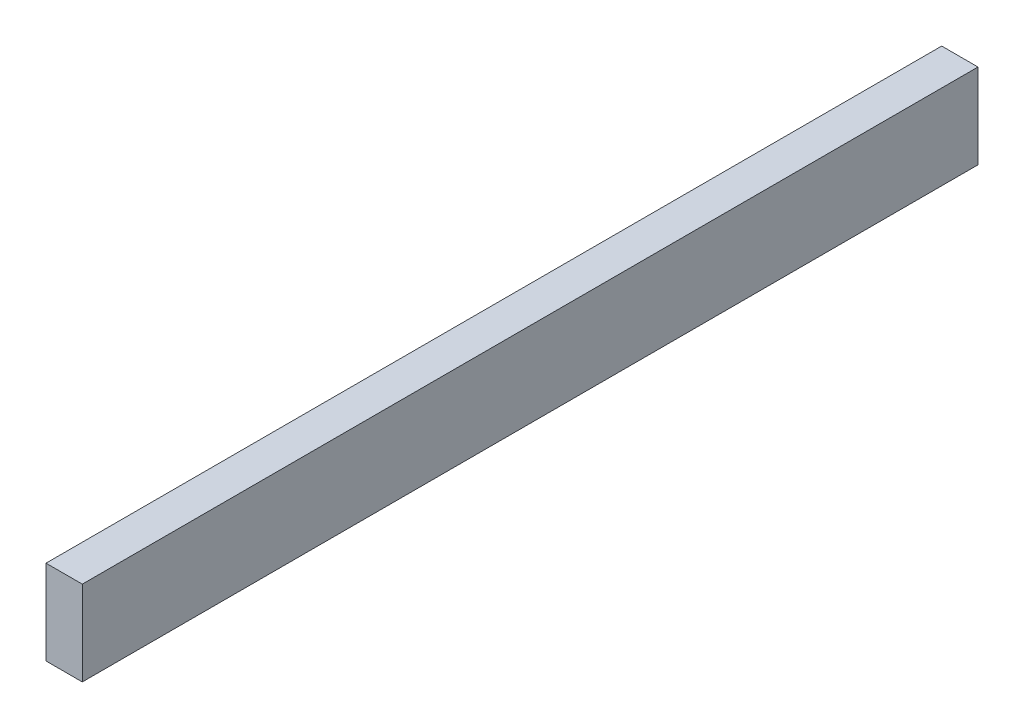
ISO-10303-21;
HEADER;
FILE_DESCRIPTION(('STEP AP214'),'2;1');
FILE_NAME('part.step','',(''),(''),'','','');
FILE_SCHEMA(('AUTOMOTIVE_DESIGN { 1 0 10303 214 1 1 1 1 }'));
ENDSEC;
DATA;
#1=APPLICATION_CONTEXT('core data for automotive mechanical design processes');
#2=APPLICATION_PROTOCOL_DEFINITION('international standard','automotive_design',2000,#1);
#3=PRODUCT_CONTEXT('',#1,'mechanical');
#4=PRODUCT('Part','Part','',(#3));
#5=PRODUCT_RELATED_PRODUCT_CATEGORY('part','',(#4));
#6=PRODUCT_DEFINITION_FORMATION('','',#4);
#7=PRODUCT_DEFINITION_CONTEXT('part definition',#1,'design');
#8=PRODUCT_DEFINITION('design','',#6,#7);
#9=PRODUCT_DEFINITION_SHAPE('','',#8);
#10=(LENGTH_UNIT() NAMED_UNIT(*) SI_UNIT(.MILLI.,.METRE.));
#11=(NAMED_UNIT(*) PLANE_ANGLE_UNIT() SI_UNIT($,.RADIAN.));
#12=(NAMED_UNIT(*) SI_UNIT($,.STERADIAN.) SOLID_ANGLE_UNIT());
#13=UNCERTAINTY_MEASURE_WITH_UNIT(LENGTH_MEASURE(1.E-05),#10,'distance_accuracy_value','');
#14=(GEOMETRIC_REPRESENTATION_CONTEXT(3) GLOBAL_UNCERTAINTY_ASSIGNED_CONTEXT((#13)) GLOBAL_UNIT_ASSIGNED_CONTEXT((#10,
#11,#12)) REPRESENTATION_CONTEXT('',''));
#15=CARTESIAN_POINT('',(0.,0.,0.));
#16=DIRECTION('',(0.,0.,1.));
#17=DIRECTION('',(1.,0.,0.));
#18=AXIS2_PLACEMENT_3D('',#15,#16,#17);
#19=CARTESIAN_POINT('',(-38.1,64.4614874823578,939.8));
#20=DIRECTION('',(1.,0.,0.));
#21=DIRECTION('',(0.,1.,0.));
#22=AXIS2_PLACEMENT_3D('',#19,#20,#21);
#23=PLANE('',#22);
#24=DIRECTION('',(0.,-1.,0.));
#25=VECTOR('',#24,1.);
#26=CARTESIAN_POINT('',(-38.1,64.4614874823578,0.));
#27=LINE('',#26,#25);
#28=CARTESIAN_POINT('',(-38.1,64.4614874823578,0.));
#29=VERTEX_POINT('',#28);
#30=CARTESIAN_POINT('',(-38.1,-24.4385125176421,0.));
#31=VERTEX_POINT('',#30);
#32=EDGE_CURVE('E95',#29,#31,#27,.T.);
#33=ORIENTED_EDGE('',*,*,#32,.T.);
#34=DIRECTION('',(0.,0.,-1.));
#35=VECTOR('',#34,1.);
#36=CARTESIAN_POINT('',(-38.1,-24.4385125176421,939.8));
#37=LINE('',#36,#35);
#38=CARTESIAN_POINT('',(-38.1,-24.4385125176421,939.8));
#39=VERTEX_POINT('',#38);
#40=EDGE_CURVE('E11',#39,#31,#37,.T.);
#41=ORIENTED_EDGE('',*,*,#40,.F.);
#42=DIRECTION('',(0.,-1.,0.));
#43=VECTOR('',#42,1.);
#44=CARTESIAN_POINT('',(-38.1,64.4614874823578,939.8));
#45=LINE('',#44,#43);
#46=CARTESIAN_POINT('',(-38.1,64.4614874823578,939.8));
#47=VERTEX_POINT('',#46);
#48=EDGE_CURVE('E83',#47,#39,#45,.T.);
#49=ORIENTED_EDGE('',*,*,#48,.F.);
#50=DIRECTION('',(0.,0.,-1.));
#51=VECTOR('',#50,1.);
#52=CARTESIAN_POINT('',(-38.1,64.4614874823578,939.8));
#53=LINE('',#52,#51);
#54=EDGE_CURVE('E91',#47,#29,#53,.T.);
#55=ORIENTED_EDGE('',*,*,#54,.T.);
#56=EDGE_LOOP('',(#33,#41,#49,#55));
#57=FACE_BOUND('',#56,.T.);
#58=ADVANCED_FACE('F32',(#57),#23,.F.);
#59=CARTESIAN_POINT('',(-38.1,-24.4385125176421,939.8));
#60=DIRECTION('',(0.,1.,0.));
#61=DIRECTION('',(-1.,0.,0.));
#62=AXIS2_PLACEMENT_3D('',#59,#60,#61);
#63=PLANE('',#62);
#64=DIRECTION('',(1.,0.,0.));
#65=VECTOR('',#64,1.);
#66=CARTESIAN_POINT('',(-38.1,-24.4385125176421,0.));
#67=LINE('',#66,#65);
#68=CARTESIAN_POINT('',(0.,-24.4385125176421,0.));
#69=VERTEX_POINT('',#68);
#70=EDGE_CURVE('E87',#31,#69,#67,.T.);
#71=ORIENTED_EDGE('',*,*,#70,.T.);
#72=DIRECTION('',(0.,0.,-1.));
#73=VECTOR('',#72,1.);
#74=CARTESIAN_POINT('',(0.,-24.4385125176421,939.8));
#75=LINE('',#74,#73);
#76=CARTESIAN_POINT('',(0.,-24.4385125176421,939.8));
#77=VERTEX_POINT('',#76);
#78=EDGE_CURVE('E40',#77,#69,#75,.T.);
#79=ORIENTED_EDGE('',*,*,#78,.F.);
#80=DIRECTION('',(1.,0.,0.));
#81=VECTOR('',#80,1.);
#82=CARTESIAN_POINT('',(-38.1,-24.4385125176421,939.8));
#83=LINE('',#82,#81);
#84=EDGE_CURVE('E78',#39,#77,#83,.T.);
#85=ORIENTED_EDGE('',*,*,#84,.F.);
#86=ORIENTED_EDGE('',*,*,#40,.T.);
#87=EDGE_LOOP('',(#71,#79,#85,#86));
#88=FACE_BOUND('',#87,.T.);
#89=ADVANCED_FACE('F86',(#88),#63,.F.);
#90=CARTESIAN_POINT('',(0.,64.4614874823578,939.8));
#91=DIRECTION('',(-1.,0.,0.));
#92=DIRECTION('',(0.,0.,1.));
#93=AXIS2_PLACEMENT_3D('',#90,#91,#92);
#94=PLANE('',#93);
#95=DIRECTION('',(0.,1.,0.));
#96=VECTOR('',#95,1.);
#97=CARTESIAN_POINT('',(0.,64.4614874823578,0.));
#98=LINE('',#97,#96);
#99=CARTESIAN_POINT('',(0.,64.4614874823578,0.));
#100=VERTEX_POINT('',#99);
#101=EDGE_CURVE('E65',#69,#100,#98,.T.);
#102=ORIENTED_EDGE('',*,*,#101,.T.);
#103=DIRECTION('',(0.,0.,-1.));
#104=VECTOR('',#103,1.);
#105=CARTESIAN_POINT('',(0.,64.4614874823578,939.8));
#106=LINE('',#105,#104);
#107=CARTESIAN_POINT('',(0.,64.4614874823578,939.8));
#108=VERTEX_POINT('',#107);
#109=EDGE_CURVE('E88',#108,#100,#106,.T.);
#110=ORIENTED_EDGE('',*,*,#109,.F.);
#111=DIRECTION('',(0.,1.,0.));
#112=VECTOR('',#111,1.);
#113=CARTESIAN_POINT('',(0.,64.4614874823578,939.8));
#114=LINE('',#113,#112);
#115=EDGE_CURVE('E81',#77,#108,#114,.T.);
#116=ORIENTED_EDGE('',*,*,#115,.F.);
#117=ORIENTED_EDGE('',*,*,#78,.T.);
#118=EDGE_LOOP('',(#102,#110,#116,#117));
#119=FACE_BOUND('',#118,.T.);
#120=ADVANCED_FACE('F89',(#119),#94,.F.);
#121=CARTESIAN_POINT('',(-38.1,64.4614874823578,939.8));
#122=DIRECTION('',(0.,-1.,0.));
#123=DIRECTION('',(0.,0.,-1.));
#124=AXIS2_PLACEMENT_3D('',#121,#122,#123);
#125=PLANE('',#124);
#126=DIRECTION('',(-1.,0.,0.));
#127=VECTOR('',#126,1.);
#128=CARTESIAN_POINT('',(-38.1,64.4614874823578,0.));
#129=LINE('',#128,#127);
#130=EDGE_CURVE('E71',#100,#29,#129,.T.);
#131=ORIENTED_EDGE('',*,*,#130,.T.);
#132=ORIENTED_EDGE('',*,*,#54,.F.);
#133=DIRECTION('',(-1.,0.,0.));
#134=VECTOR('',#133,1.);
#135=CARTESIAN_POINT('',(-38.1,64.4614874823578,939.8));
#136=LINE('',#135,#134);
#137=EDGE_CURVE('E48',#108,#47,#136,.T.);
#138=ORIENTED_EDGE('',*,*,#137,.F.);
#139=ORIENTED_EDGE('',*,*,#109,.T.);
#140=EDGE_LOOP('',(#131,#132,#138,#139));
#141=FACE_BOUND('',#140,.T.);
#142=ADVANCED_FACE('F102',(#141),#125,.F.);
#143=CARTESIAN_POINT('',(0.,0.,939.8));
#144=DIRECTION('',(0.,0.,1.));
#145=DIRECTION('',(1.,0.,0.));
#146=AXIS2_PLACEMENT_3D('',#143,#144,#145);
#147=PLANE('',#146);
#148=ORIENTED_EDGE('',*,*,#48,.T.);
#149=ORIENTED_EDGE('',*,*,#84,.T.);
#150=ORIENTED_EDGE('',*,*,#115,.T.);
#151=ORIENTED_EDGE('',*,*,#137,.T.);
#152=EDGE_LOOP('',(#148,#149,#150,#151));
#153=FACE_BOUND('',#152,.T.);
#154=ADVANCED_FACE('F79',(#153),#147,.T.);
#155=CARTESIAN_POINT('',(0.,0.,0.));
#156=DIRECTION('',(0.,0.,1.));
#157=DIRECTION('',(1.,0.,0.));
#158=AXIS2_PLACEMENT_3D('',#155,#156,#157);
#159=PLANE('',#158);
#160=ORIENTED_EDGE('',*,*,#32,.F.);
#161=ORIENTED_EDGE('',*,*,#130,.F.);
#162=ORIENTED_EDGE('',*,*,#101,.F.);
#163=ORIENTED_EDGE('',*,*,#70,.F.);
#164=EDGE_LOOP('',(#160,#161,#162,#163));
#165=FACE_BOUND('',#164,.T.);
#166=ADVANCED_FACE('F105',(#165),#159,.F.);
#167=CLOSED_SHELL('',(#58,#89,#120,#142,#154,#166));
#168=MANIFOLD_SOLID_BREP('B2',#167);
#169=ADVANCED_BREP_SHAPE_REPRESENTATION('',(#18,#168),#14);
#170=SHAPE_DEFINITION_REPRESENTATION(#9,#169);
ENDSEC;
END-ISO-10303-21;
